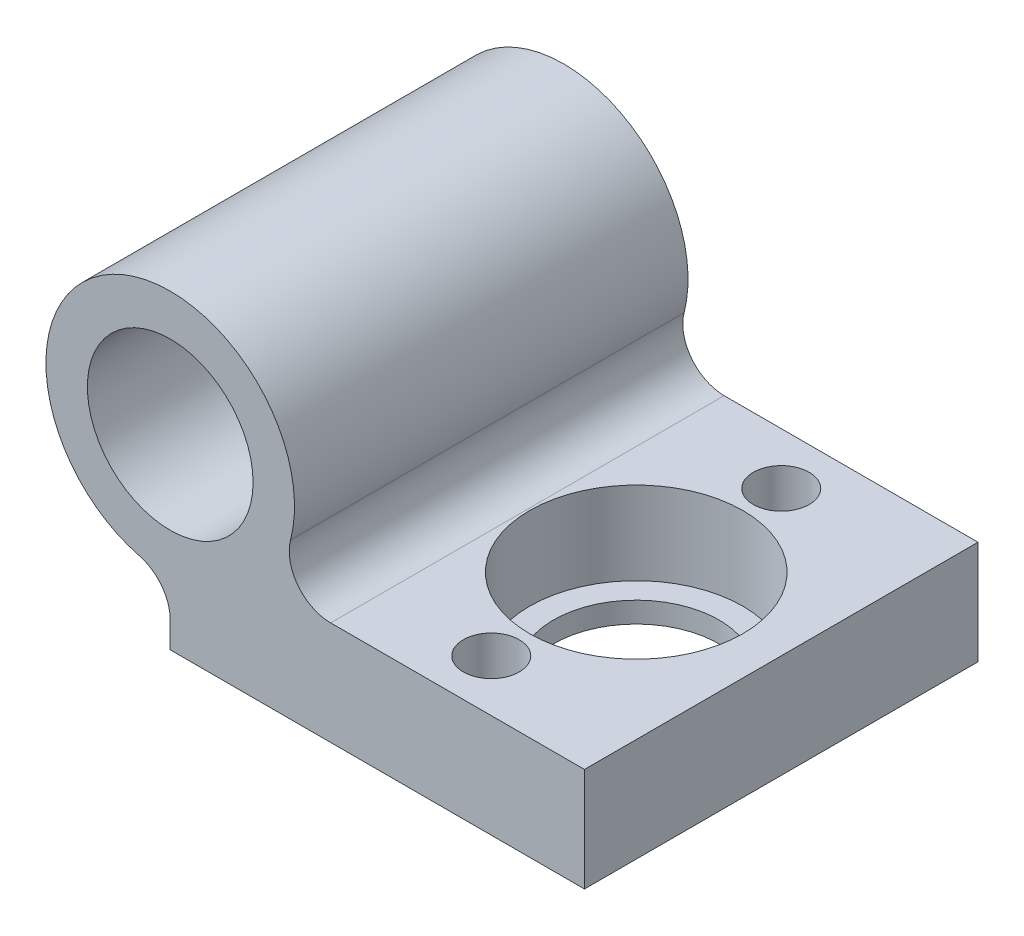
ISO-10303-21;
HEADER;
FILE_DESCRIPTION(('STEP AP214'),'2;1');
FILE_NAME('part.step','',(''),(''),'','','');
FILE_SCHEMA(('AUTOMOTIVE_DESIGN { 1 0 10303 214 1 1 1 1 }'));
ENDSEC;
DATA;
#1=APPLICATION_CONTEXT('core data for automotive mechanical design processes');
#2=APPLICATION_PROTOCOL_DEFINITION('international standard','automotive_design',2000,#1);
#3=PRODUCT_CONTEXT('',#1,'mechanical');
#4=PRODUCT('Part','Part','',(#3));
#5=PRODUCT_RELATED_PRODUCT_CATEGORY('part','',(#4));
#6=PRODUCT_DEFINITION_FORMATION('','',#4);
#7=PRODUCT_DEFINITION_CONTEXT('part definition',#1,'design');
#8=PRODUCT_DEFINITION('design','',#6,#7);
#9=PRODUCT_DEFINITION_SHAPE('','',#8);
#10=(LENGTH_UNIT() NAMED_UNIT(*) SI_UNIT(.MILLI.,.METRE.));
#11=(NAMED_UNIT(*) PLANE_ANGLE_UNIT() SI_UNIT($,.RADIAN.));
#12=(NAMED_UNIT(*) SI_UNIT($,.STERADIAN.) SOLID_ANGLE_UNIT());
#13=UNCERTAINTY_MEASURE_WITH_UNIT(LENGTH_MEASURE(1.E-05),#10,'distance_accuracy_value','');
#14=(GEOMETRIC_REPRESENTATION_CONTEXT(3) GLOBAL_UNCERTAINTY_ASSIGNED_CONTEXT((#13)) GLOBAL_UNIT_ASSIGNED_CONTEXT((#10,
#11,#12)) REPRESENTATION_CONTEXT('',''));
#15=CARTESIAN_POINT('',(0.,0.,0.));
#16=DIRECTION('',(0.,0.,1.));
#17=DIRECTION('',(1.,0.,0.));
#18=AXIS2_PLACEMENT_3D('',#15,#16,#17);
#19=CARTESIAN_POINT('',(13.,-4.,0.));
#20=DIRECTION('',(0.,-1.,0.));
#21=DIRECTION('',(0.,0.,-1.));
#22=AXIS2_PLACEMENT_3D('',#19,#20,#21);
#23=CYLINDRICAL_SURFACE('',#22,4.);
#24=CARTESIAN_POINT('',(13.,-9.,0.));
#25=DIRECTION('',(0.,1.,0.));
#26=DIRECTION('',(0.,0.,1.));
#27=AXIS2_PLACEMENT_3D('',#24,#25,#26);
#28=CIRCLE('',#27,4.);
#29=CARTESIAN_POINT('',(13.,-9.,4.));
#30=VERTEX_POINT('',#29);
#31=EDGE_CURVE('E327',#30,#30,#28,.T.);
#32=ORIENTED_EDGE('',*,*,#31,.F.);
#33=EDGE_LOOP('',(#32));
#34=FACE_BOUND('',#33,.T.);
#35=CARTESIAN_POINT('',(13.,-8.,0.));
#36=DIRECTION('',(0.,1.,0.));
#37=DIRECTION('',(0.,0.,1.));
#38=AXIS2_PLACEMENT_3D('',#35,#36,#37);
#39=CIRCLE('',#38,4.);
#40=CARTESIAN_POINT('',(13.,-8.,4.));
#41=VERTEX_POINT('',#40);
#42=EDGE_CURVE('E141',#41,#41,#39,.T.);
#43=ORIENTED_EDGE('',*,*,#42,.T.);
#44=EDGE_LOOP('',(#43));
#45=FACE_BOUND('',#44,.T.);
#46=ADVANCED_FACE('F33',(#34,#45),#23,.F.);
#47=CARTESIAN_POINT('',(0.,0.,9.5));
#48=DIRECTION('',(0.,0.,1.));
#49=DIRECTION('',(1.,0.,0.));
#50=AXIS2_PLACEMENT_3D('',#47,#48,#49);
#51=PLANE('',#50);
#52=CARTESIAN_POINT('',(0.,0.,9.5));
#53=DIRECTION('',(0.,0.,1.));
#54=DIRECTION('',(1.,0.,0.));
#55=AXIS2_PLACEMENT_3D('',#52,#53,#54);
#56=CIRCLE('',#55,4.);
#57=CARTESIAN_POINT('',(4.,0.,9.5));
#58=VERTEX_POINT('',#57);
#59=EDGE_CURVE('E129',#58,#58,#56,.T.);
#60=ORIENTED_EDGE('',*,*,#59,.F.);
#61=EDGE_LOOP('',(#60));
#62=FACE_BOUND('',#61,.T.);
#63=DIRECTION('',(1.,0.,0.));
#64=VECTOR('',#63,1.);
#65=CARTESIAN_POINT('',(0.,-4.,9.5));
#66=LINE('',#65,#64);
#67=CARTESIAN_POINT('',(7.74596669241483,-4.,9.5));
#68=VERTEX_POINT('',#67);
#69=CARTESIAN_POINT('',(20.,-4.,9.5));
#70=VERTEX_POINT('',#69);
#71=EDGE_CURVE('E88',#68,#70,#66,.T.);
#72=ORIENTED_EDGE('',*,*,#71,.F.);
#73=CARTESIAN_POINT('',(7.74596669241483,-2.,9.5));
#74=DIRECTION('',(0.,0.,1.));
#75=DIRECTION('',(1.,0.,0.));
#76=AXIS2_PLACEMENT_3D('',#73,#74,#75);
#77=CIRCLE('',#76,2.);
#78=CARTESIAN_POINT('',(5.80947501931113,-1.5,9.5));
#79=VERTEX_POINT('',#78);
#80=EDGE_CURVE('E11',#68,#79,#77,.F.);
#81=ORIENTED_EDGE('',*,*,#80,.T.);
#82=CARTESIAN_POINT('',(0.,0.,9.5));
#83=DIRECTION('',(0.,0.,1.));
#84=DIRECTION('',(1.,0.,0.));
#85=AXIS2_PLACEMENT_3D('',#82,#83,#84);
#86=CIRCLE('',#85,6.);
#87=CARTESIAN_POINT('',(-1.5,-5.80947501931113,9.5));
#88=VERTEX_POINT('',#87);
#89=EDGE_CURVE('E135',#79,#88,#86,.T.);
#90=ORIENTED_EDGE('',*,*,#89,.T.);
#91=CARTESIAN_POINT('',(-2.,-7.74596669241483,9.5));
#92=DIRECTION('',(0.,0.,1.));
#93=DIRECTION('',(1.,0.,0.));
#94=AXIS2_PLACEMENT_3D('',#91,#92,#93);
#95=CIRCLE('',#94,2.);
#96=CARTESIAN_POINT('',(0.,-7.74596669241483,9.5));
#97=VERTEX_POINT('',#96);
#98=EDGE_CURVE('E156',#88,#97,#95,.F.);
#99=ORIENTED_EDGE('',*,*,#98,.T.);
#100=DIRECTION('',(0.,-1.,0.));
#101=VECTOR('',#100,1.);
#102=CARTESIAN_POINT('',(0.,-4.,9.5));
#103=LINE('',#102,#101);
#104=CARTESIAN_POINT('',(0.,-9.,9.5));
#105=VERTEX_POINT('',#104);
#106=EDGE_CURVE('E105',#97,#105,#103,.T.);
#107=ORIENTED_EDGE('',*,*,#106,.T.);
#108=DIRECTION('',(1.,0.,0.));
#109=VECTOR('',#108,1.);
#110=CARTESIAN_POINT('',(0.,-9.,9.5));
#111=LINE('',#110,#109);
#112=CARTESIAN_POINT('',(20.,-9.,9.5));
#113=VERTEX_POINT('',#112);
#114=EDGE_CURVE('E102',#105,#113,#111,.T.);
#115=ORIENTED_EDGE('',*,*,#114,.T.);
#116=DIRECTION('',(0.,-1.,0.));
#117=VECTOR('',#116,1.);
#118=CARTESIAN_POINT('',(20.,-4.,9.5));
#119=LINE('',#118,#117);
#120=EDGE_CURVE('E99',#70,#113,#119,.T.);
#121=ORIENTED_EDGE('',*,*,#120,.F.);
#122=EDGE_LOOP('',(#72,#81,#90,#99,#107,#115,#121));
#123=FACE_BOUND('',#122,.T.);
#124=ADVANCED_FACE('F100',(#62,#123),#51,.T.);
#125=CARTESIAN_POINT('',(0.,0.,-9.5));
#126=DIRECTION('',(0.,0.,1.));
#127=DIRECTION('',(1.,0.,0.));
#128=AXIS2_PLACEMENT_3D('',#125,#126,#127);
#129=PLANE('',#128);
#130=CARTESIAN_POINT('',(0.,0.,-9.5));
#131=DIRECTION('',(0.,0.,1.));
#132=DIRECTION('',(1.,0.,0.));
#133=AXIS2_PLACEMENT_3D('',#130,#131,#132);
#134=CIRCLE('',#133,4.);
#135=CARTESIAN_POINT('',(4.,0.,-9.5));
#136=VERTEX_POINT('',#135);
#137=EDGE_CURVE('E128',#136,#136,#134,.T.);
#138=ORIENTED_EDGE('',*,*,#137,.T.);
#139=EDGE_LOOP('',(#138));
#140=FACE_BOUND('',#139,.T.);
#141=CARTESIAN_POINT('',(0.,0.,-9.5));
#142=DIRECTION('',(0.,0.,1.));
#143=DIRECTION('',(1.,0.,0.));
#144=AXIS2_PLACEMENT_3D('',#141,#142,#143);
#145=CIRCLE('',#144,6.);
#146=CARTESIAN_POINT('',(5.80947501931113,-1.5,-9.5));
#147=VERTEX_POINT('',#146);
#148=CARTESIAN_POINT('',(-1.5,-5.80947501931113,-9.5));
#149=VERTEX_POINT('',#148);
#150=EDGE_CURVE('E132',#147,#149,#145,.T.);
#151=ORIENTED_EDGE('',*,*,#150,.F.);
#152=CARTESIAN_POINT('',(7.74596669241483,-2.,-9.5));
#153=DIRECTION('',(0.,0.,1.));
#154=DIRECTION('',(1.,0.,0.));
#155=AXIS2_PLACEMENT_3D('',#152,#153,#154);
#156=CIRCLE('',#155,2.);
#157=CARTESIAN_POINT('',(7.74596669241483,-4.,-9.5));
#158=VERTEX_POINT('',#157);
#159=EDGE_CURVE('E41',#147,#158,#156,.T.);
#160=ORIENTED_EDGE('',*,*,#159,.T.);
#161=DIRECTION('',(-1.,0.,0.));
#162=VECTOR('',#161,1.);
#163=CARTESIAN_POINT('',(0.,-4.,-9.5));
#164=LINE('',#163,#162);
#165=CARTESIAN_POINT('',(20.,-4.,-9.5));
#166=VERTEX_POINT('',#165);
#167=EDGE_CURVE('E110',#166,#158,#164,.T.);
#168=ORIENTED_EDGE('',*,*,#167,.F.);
#169=DIRECTION('',(0.,-1.,0.));
#170=VECTOR('',#169,1.);
#171=CARTESIAN_POINT('',(20.,-4.,-9.5));
#172=LINE('',#171,#170);
#173=CARTESIAN_POINT('',(20.,-9.,-9.5));
#174=VERTEX_POINT('',#173);
#175=EDGE_CURVE('E106',#166,#174,#172,.T.);
#176=ORIENTED_EDGE('',*,*,#175,.T.);
#177=DIRECTION('',(-1.,0.,0.));
#178=VECTOR('',#177,1.);
#179=CARTESIAN_POINT('',(0.,-9.,-9.5));
#180=LINE('',#179,#178);
#181=CARTESIAN_POINT('',(0.,-9.,-9.5));
#182=VERTEX_POINT('',#181);
#183=EDGE_CURVE('E96',#174,#182,#180,.T.);
#184=ORIENTED_EDGE('',*,*,#183,.T.);
#185=DIRECTION('',(0.,-1.,0.));
#186=VECTOR('',#185,1.);
#187=CARTESIAN_POINT('',(0.,-4.,-9.5));
#188=LINE('',#187,#186);
#189=CARTESIAN_POINT('',(0.,-7.74596669241483,-9.5));
#190=VERTEX_POINT('',#189);
#191=EDGE_CURVE('E112',#190,#182,#188,.T.);
#192=ORIENTED_EDGE('',*,*,#191,.F.);
#193=CARTESIAN_POINT('',(-2.,-7.74596669241483,-9.5));
#194=DIRECTION('',(0.,0.,1.));
#195=DIRECTION('',(1.,0.,0.));
#196=AXIS2_PLACEMENT_3D('',#193,#194,#195);
#197=CIRCLE('',#196,2.);
#198=EDGE_CURVE('E154',#190,#149,#197,.T.);
#199=ORIENTED_EDGE('',*,*,#198,.T.);
#200=EDGE_LOOP('',(#151,#160,#168,#176,#184,#192,#199));
#201=FACE_BOUND('',#200,.T.);
#202=ADVANCED_FACE('F168',(#140,#201),#129,.F.);
#203=CARTESIAN_POINT('',(0.,0.,9.5));
#204=DIRECTION('',(0.,0.,-1.));
#205=DIRECTION('',(-1.,0.,0.));
#206=AXIS2_PLACEMENT_3D('',#203,#204,#205);
#207=CYLINDRICAL_SURFACE('',#206,6.);
#208=ORIENTED_EDGE('',*,*,#150,.T.);
#209=DIRECTION('',(0.,0.,-1.));
#210=VECTOR('',#209,1.);
#211=CARTESIAN_POINT('',(-1.5,-5.80947501931113,9.5));
#212=LINE('',#211,#210);
#213=EDGE_CURVE('E151',#149,#88,#212,.F.);
#214=ORIENTED_EDGE('',*,*,#213,.T.);
#215=ORIENTED_EDGE('',*,*,#89,.F.);
#216=DIRECTION('',(0.,0.,-1.));
#217=VECTOR('',#216,1.);
#218=CARTESIAN_POINT('',(5.80947501931113,-1.5,9.5));
#219=LINE('',#218,#217);
#220=EDGE_CURVE('E148',#79,#147,#219,.T.);
#221=ORIENTED_EDGE('',*,*,#220,.T.);
#222=EDGE_LOOP('',(#208,#214,#215,#221));
#223=FACE_BOUND('',#222,.T.);
#224=ADVANCED_FACE('F170',(#223),#207,.T.);
#225=CARTESIAN_POINT('',(0.,0.,9.5));
#226=DIRECTION('',(0.,0.,-1.));
#227=DIRECTION('',(-1.,0.,0.));
#228=AXIS2_PLACEMENT_3D('',#225,#226,#227);
#229=CYLINDRICAL_SURFACE('',#228,4.);
#230=ORIENTED_EDGE('',*,*,#137,.F.);
#231=EDGE_LOOP('',(#230));
#232=FACE_BOUND('',#231,.T.);
#233=ORIENTED_EDGE('',*,*,#59,.T.);
#234=EDGE_LOOP('',(#233));
#235=FACE_BOUND('',#234,.T.);
#236=ADVANCED_FACE('F198',(#232,#235),#229,.F.);
#237=CARTESIAN_POINT('',(0.,-4.,0.));
#238=DIRECTION('',(0.,1.,0.));
#239=DIRECTION('',(0.,0.,1.));
#240=AXIS2_PLACEMENT_3D('',#237,#238,#239);
#241=PLANE('',#240);
#242=CARTESIAN_POINT('',(13.,-4.,0.));
#243=DIRECTION('',(0.,1.,0.));
#244=DIRECTION('',(0.,0.,1.));
#245=AXIS2_PLACEMENT_3D('',#242,#243,#244);
#246=CIRCLE('',#245,5.15);
#247=CARTESIAN_POINT('',(13.,-4.,5.15));
#248=VERTEX_POINT('',#247);
#249=EDGE_CURVE('E319',#248,#248,#246,.T.);
#250=ORIENTED_EDGE('',*,*,#249,.F.);
#251=EDGE_LOOP('',(#250));
#252=FACE_BOUND('',#251,.T.);
#253=CARTESIAN_POINT('',(13.,-4.,-7.));
#254=DIRECTION('',(0.,1.,0.));
#255=DIRECTION('',(0.,0.,1.));
#256=AXIS2_PLACEMENT_3D('',#253,#254,#255);
#257=CIRCLE('',#256,1.35);
#258=CARTESIAN_POINT('',(13.,-4.,-5.65));
#259=VERTEX_POINT('',#258);
#260=EDGE_CURVE('E324',#259,#259,#257,.T.);
#261=ORIENTED_EDGE('',*,*,#260,.F.);
#262=EDGE_LOOP('',(#261));
#263=FACE_BOUND('',#262,.T.);
#264=CARTESIAN_POINT('',(13.,-4.,7.));
#265=DIRECTION('',(0.,1.,0.));
#266=DIRECTION('',(0.,0.,1.));
#267=AXIS2_PLACEMENT_3D('',#264,#265,#266);
#268=CIRCLE('',#267,1.35);
#269=CARTESIAN_POINT('',(13.,-4.,8.35));
#270=VERTEX_POINT('',#269);
#271=EDGE_CURVE('E119',#270,#270,#268,.T.);
#272=ORIENTED_EDGE('',*,*,#271,.F.);
#273=EDGE_LOOP('',(#272));
#274=FACE_BOUND('',#273,.T.);
#275=ORIENTED_EDGE('',*,*,#167,.T.);
#276=DIRECTION('',(0.,0.,-1.));
#277=VECTOR('',#276,1.);
#278=CARTESIAN_POINT('',(7.74596669241483,-4.,0.));
#279=LINE('',#278,#277);
#280=EDGE_CURVE('E54',#158,#68,#279,.F.);
#281=ORIENTED_EDGE('',*,*,#280,.T.);
#282=ORIENTED_EDGE('',*,*,#71,.T.);
#283=DIRECTION('',(0.,0.,-1.));
#284=VECTOR('',#283,1.);
#285=CARTESIAN_POINT('',(20.,-4.,-9.5));
#286=LINE('',#285,#284);
#287=EDGE_CURVE('E92',#70,#166,#286,.T.);
#288=ORIENTED_EDGE('',*,*,#287,.T.);
#289=EDGE_LOOP('',(#275,#281,#282,#288));
#290=FACE_BOUND('',#289,.T.);
#291=ADVANCED_FACE('F90',(#252,#263,#274,#290),#241,.T.);
#292=CARTESIAN_POINT('',(0.,-4.,-9.5));
#293=DIRECTION('',(1.,0.,0.));
#294=DIRECTION('',(0.,0.,-1.));
#295=AXIS2_PLACEMENT_3D('',#292,#293,#294);
#296=PLANE('',#295);
#297=ORIENTED_EDGE('',*,*,#106,.F.);
#298=DIRECTION('',(0.,0.,1.));
#299=VECTOR('',#298,1.);
#300=CARTESIAN_POINT('',(0.,-7.74596669241483,-9.5));
#301=LINE('',#300,#299);
#302=EDGE_CURVE('E138',#97,#190,#301,.F.);
#303=ORIENTED_EDGE('',*,*,#302,.T.);
#304=ORIENTED_EDGE('',*,*,#191,.T.);
#305=DIRECTION('',(0.,0.,1.));
#306=VECTOR('',#305,1.);
#307=CARTESIAN_POINT('',(0.,-9.,-9.5));
#308=LINE('',#307,#306);
#309=EDGE_CURVE('E116',#182,#105,#308,.T.);
#310=ORIENTED_EDGE('',*,*,#309,.T.);
#311=EDGE_LOOP('',(#297,#303,#304,#310));
#312=FACE_BOUND('',#311,.T.);
#313=ADVANCED_FACE('F164',(#312),#296,.F.);
#314=CARTESIAN_POINT('',(0.,-9.,0.));
#315=DIRECTION('',(0.,1.,0.));
#316=DIRECTION('',(0.,0.,1.));
#317=AXIS2_PLACEMENT_3D('',#314,#315,#316);
#318=PLANE('',#317);
#319=ORIENTED_EDGE('',*,*,#309,.F.);
#320=ORIENTED_EDGE('',*,*,#183,.F.);
#321=DIRECTION('',(0.,0.,-1.));
#322=VECTOR('',#321,1.);
#323=CARTESIAN_POINT('',(20.,-9.,-9.5));
#324=LINE('',#323,#322);
#325=EDGE_CURVE('E121',#113,#174,#324,.T.);
#326=ORIENTED_EDGE('',*,*,#325,.F.);
#327=ORIENTED_EDGE('',*,*,#114,.F.);
#328=EDGE_LOOP('',(#319,#320,#326,#327));
#329=FACE_BOUND('',#328,.T.);
#330=CARTESIAN_POINT('',(13.,-9.,7.));
#331=DIRECTION('',(0.,1.,0.));
#332=DIRECTION('',(0.,0.,1.));
#333=AXIS2_PLACEMENT_3D('',#330,#331,#332);
#334=CIRCLE('',#333,1.35);
#335=CARTESIAN_POINT('',(13.,-9.,8.35));
#336=VERTEX_POINT('',#335);
#337=EDGE_CURVE('E332',#336,#336,#334,.T.);
#338=ORIENTED_EDGE('',*,*,#337,.T.);
#339=EDGE_LOOP('',(#338));
#340=FACE_BOUND('',#339,.T.);
#341=ORIENTED_EDGE('',*,*,#31,.T.);
#342=EDGE_LOOP('',(#341));
#343=FACE_BOUND('',#342,.T.);
#344=CARTESIAN_POINT('',(13.,-9.,-7.));
#345=DIRECTION('',(0.,1.,0.));
#346=DIRECTION('',(0.,0.,1.));
#347=AXIS2_PLACEMENT_3D('',#344,#345,#346);
#348=CIRCLE('',#347,1.35);
#349=CARTESIAN_POINT('',(13.,-9.,-5.65));
#350=VERTEX_POINT('',#349);
#351=EDGE_CURVE('E144',#350,#350,#348,.T.);
#352=ORIENTED_EDGE('',*,*,#351,.T.);
#353=EDGE_LOOP('',(#352));
#354=FACE_BOUND('',#353,.T.);
#355=ADVANCED_FACE('F200',(#329,#340,#343,#354),#318,.F.);
#356=CARTESIAN_POINT('',(20.,-4.,-9.5));
#357=DIRECTION('',(-1.,0.,0.));
#358=DIRECTION('',(0.,0.,1.));
#359=AXIS2_PLACEMENT_3D('',#356,#357,#358);
#360=PLANE('',#359);
#361=ORIENTED_EDGE('',*,*,#325,.T.);
#362=ORIENTED_EDGE('',*,*,#175,.F.);
#363=ORIENTED_EDGE('',*,*,#287,.F.);
#364=ORIENTED_EDGE('',*,*,#120,.T.);
#365=EDGE_LOOP('',(#361,#362,#363,#364));
#366=FACE_BOUND('',#365,.T.);
#367=ADVANCED_FACE('F108',(#366),#360,.F.);
#368=CARTESIAN_POINT('',(13.,-4.,7.));
#369=DIRECTION('',(0.,-1.,0.));
#370=DIRECTION('',(0.,0.,-1.));
#371=AXIS2_PLACEMENT_3D('',#368,#369,#370);
#372=CYLINDRICAL_SURFACE('',#371,1.35);
#373=ORIENTED_EDGE('',*,*,#271,.T.);
#374=EDGE_LOOP('',(#373));
#375=FACE_BOUND('',#374,.T.);
#376=ORIENTED_EDGE('',*,*,#337,.F.);
#377=EDGE_LOOP('',(#376));
#378=FACE_BOUND('',#377,.T.);
#379=ADVANCED_FACE('F192',(#375,#378),#372,.F.);
#380=CARTESIAN_POINT('',(13.,-4.,-7.));
#381=DIRECTION('',(0.,-1.,0.));
#382=DIRECTION('',(0.,0.,-1.));
#383=AXIS2_PLACEMENT_3D('',#380,#381,#382);
#384=CYLINDRICAL_SURFACE('',#383,1.35);
#385=ORIENTED_EDGE('',*,*,#260,.T.);
#386=EDGE_LOOP('',(#385));
#387=FACE_BOUND('',#386,.T.);
#388=ORIENTED_EDGE('',*,*,#351,.F.);
#389=EDGE_LOOP('',(#388));
#390=FACE_BOUND('',#389,.T.);
#391=ADVANCED_FACE('F190',(#387,#390),#384,.F.);
#392=CARTESIAN_POINT('',(13.,-8.,0.));
#393=DIRECTION('',(0.,1.,0.));
#394=DIRECTION('',(0.,0.,1.));
#395=AXIS2_PLACEMENT_3D('',#392,#393,#394);
#396=CYLINDRICAL_SURFACE('',#395,5.15);
#397=CARTESIAN_POINT('',(13.,-8.,0.));
#398=DIRECTION('',(0.,1.,0.));
#399=DIRECTION('',(0.,0.,1.));
#400=AXIS2_PLACEMENT_3D('',#397,#398,#399);
#401=CIRCLE('',#400,5.15);
#402=CARTESIAN_POINT('',(13.,-8.,5.15));
#403=VERTEX_POINT('',#402);
#404=EDGE_CURVE('E145',#403,#403,#401,.T.);
#405=ORIENTED_EDGE('',*,*,#404,.F.);
#406=EDGE_LOOP('',(#405));
#407=FACE_BOUND('',#406,.T.);
#408=ORIENTED_EDGE('',*,*,#249,.T.);
#409=EDGE_LOOP('',(#408));
#410=FACE_BOUND('',#409,.T.);
#411=ADVANCED_FACE('F250',(#407,#410),#396,.F.);
#412=CARTESIAN_POINT('',(13.,-8.,0.));
#413=DIRECTION('',(0.,1.,0.));
#414=DIRECTION('',(0.,0.,1.));
#415=AXIS2_PLACEMENT_3D('',#412,#413,#414);
#416=PLANE('',#415);
#417=ORIENTED_EDGE('',*,*,#42,.F.);
#418=EDGE_LOOP('',(#417));
#419=FACE_BOUND('',#418,.T.);
#420=ORIENTED_EDGE('',*,*,#404,.T.);
#421=EDGE_LOOP('',(#420));
#422=FACE_BOUND('',#421,.T.);
#423=ADVANCED_FACE('F177',(#419,#422),#416,.T.);
#424=CARTESIAN_POINT('',(-2.,-7.74596669241483,9.5));
#425=DIRECTION('',(0.,0.,-1.));
#426=DIRECTION('',(-1.,0.,0.));
#427=AXIS2_PLACEMENT_3D('',#424,#425,#426);
#428=CYLINDRICAL_SURFACE('',#427,2.);
#429=ORIENTED_EDGE('',*,*,#98,.F.);
#430=ORIENTED_EDGE('',*,*,#213,.F.);
#431=ORIENTED_EDGE('',*,*,#198,.F.);
#432=ORIENTED_EDGE('',*,*,#302,.F.);
#433=EDGE_LOOP('',(#429,#430,#431,#432));
#434=FACE_BOUND('',#433,.T.);
#435=ADVANCED_FACE('F167',(#434),#428,.F.);
#436=CARTESIAN_POINT('',(7.74596669241483,-2.,9.5));
#437=DIRECTION('',(0.,0.,-1.));
#438=DIRECTION('',(-1.,0.,0.));
#439=AXIS2_PLACEMENT_3D('',#436,#437,#438);
#440=CYLINDRICAL_SURFACE('',#439,2.);
#441=ORIENTED_EDGE('',*,*,#80,.F.);
#442=ORIENTED_EDGE('',*,*,#280,.F.);
#443=ORIENTED_EDGE('',*,*,#159,.F.);
#444=ORIENTED_EDGE('',*,*,#220,.F.);
#445=EDGE_LOOP('',(#441,#442,#443,#444));
#446=FACE_BOUND('',#445,.T.);
#447=ADVANCED_FACE('F35',(#446),#440,.F.);
#448=CLOSED_SHELL('',(#46,#124,#202,#224,#236,#291,#313,#355,#367,#379,#391,#411,#423,#435,#447));
#449=MANIFOLD_SOLID_BREP('B2',#448);
#450=ADVANCED_BREP_SHAPE_REPRESENTATION('',(#18,#449),#14);
#451=SHAPE_DEFINITION_REPRESENTATION(#9,#450);
ENDSEC;
END-ISO-10303-21;
